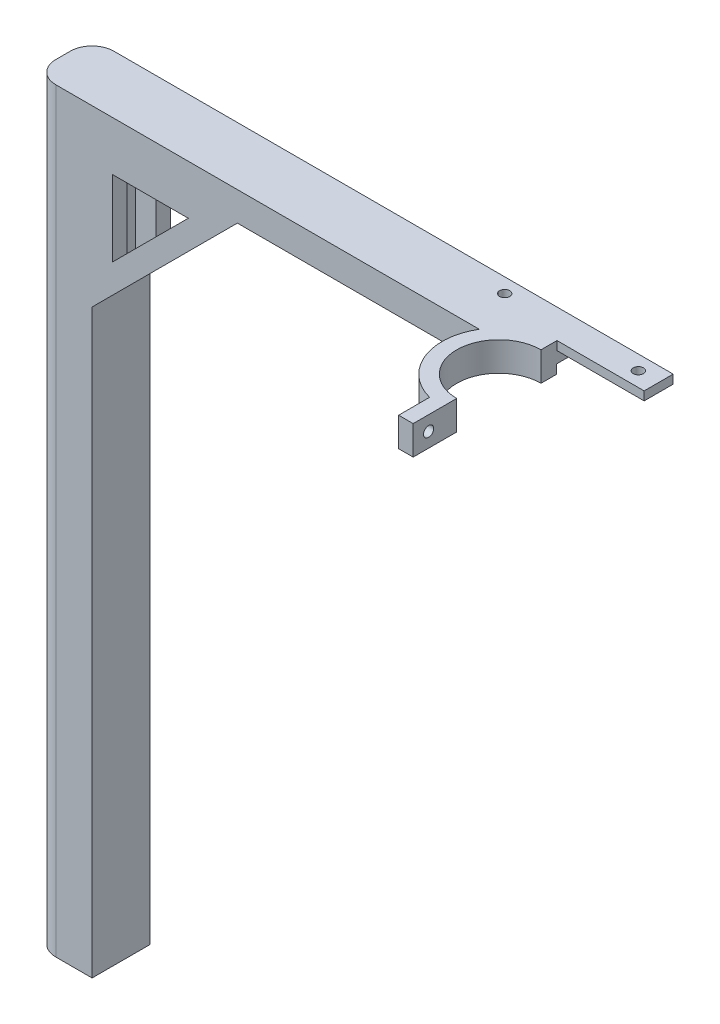
ISO-10303-21;
HEADER;
FILE_DESCRIPTION(('STEP AP214'),'2;1');
FILE_NAME('part.step','',(''),(''),'','','');
FILE_SCHEMA(('AUTOMOTIVE_DESIGN { 1 0 10303 214 1 1 1 1 }'));
ENDSEC;
DATA;
#1=APPLICATION_CONTEXT('core data for automotive mechanical design processes');
#2=APPLICATION_PROTOCOL_DEFINITION('international standard','automotive_design',2000,#1);
#3=PRODUCT_CONTEXT('',#1,'mechanical');
#4=PRODUCT('Part','Part','',(#3));
#5=PRODUCT_RELATED_PRODUCT_CATEGORY('part','',(#4));
#6=PRODUCT_DEFINITION_FORMATION('','',#4);
#7=PRODUCT_DEFINITION_CONTEXT('part definition',#1,'design');
#8=PRODUCT_DEFINITION('design','',#6,#7);
#9=PRODUCT_DEFINITION_SHAPE('','',#8);
#10=(LENGTH_UNIT() NAMED_UNIT(*) SI_UNIT(.MILLI.,.METRE.));
#11=(NAMED_UNIT(*) PLANE_ANGLE_UNIT() SI_UNIT($,.RADIAN.));
#12=(NAMED_UNIT(*) SI_UNIT($,.STERADIAN.) SOLID_ANGLE_UNIT());
#13=UNCERTAINTY_MEASURE_WITH_UNIT(LENGTH_MEASURE(1.E-05),#10,'distance_accuracy_value','');
#14=(GEOMETRIC_REPRESENTATION_CONTEXT(3) GLOBAL_UNCERTAINTY_ASSIGNED_CONTEXT((#13)) GLOBAL_UNIT_ASSIGNED_CONTEXT((#10,
#11,#12)) REPRESENTATION_CONTEXT('',''));
#15=CARTESIAN_POINT('',(0.,0.,0.));
#16=DIRECTION('',(0.,0.,1.));
#17=DIRECTION('',(1.,0.,0.));
#18=AXIS2_PLACEMENT_3D('',#15,#16,#17);
#19=CARTESIAN_POINT('',(170.,0.,0.));
#20=DIRECTION('',(1.,0.,0.));
#21=DIRECTION('',(0.,0.,-1.));
#22=AXIS2_PLACEMENT_3D('',#19,#20,#21);
#23=PLANE('',#22);
#24=DIRECTION('',(0.,-1.,0.));
#25=VECTOR('',#24,1.);
#26=CARTESIAN_POINT('',(170.,250.,-9.9));
#27=LINE('',#26,#25);
#28=CARTESIAN_POINT('',(170.,253.1,-9.9));
#29=VERTEX_POINT('',#28);
#30=CARTESIAN_POINT('',(170.,250.,-9.9));
#31=VERTEX_POINT('',#30);
#32=EDGE_CURVE('E284',#29,#31,#27,.T.);
#33=ORIENTED_EDGE('',*,*,#32,.F.);
#34=DIRECTION('',(0.,0.,1.));
#35=VECTOR('',#34,1.);
#36=CARTESIAN_POINT('',(170.,253.1,-20.));
#37=LINE('',#36,#35);
#38=CARTESIAN_POINT('',(170.,253.1,-20.));
#39=VERTEX_POINT('',#38);
#40=EDGE_CURVE('E519',#39,#29,#37,.T.);
#41=ORIENTED_EDGE('',*,*,#40,.F.);
#42=DIRECTION('',(0.,1.,0.));
#43=VECTOR('',#42,1.);
#44=CARTESIAN_POINT('',(170.,260.,-20.));
#45=LINE('',#44,#43);
#46=CARTESIAN_POINT('',(170.,257.,-20.));
#47=VERTEX_POINT('',#46);
#48=EDGE_CURVE('E290',#39,#47,#45,.T.);
#49=ORIENTED_EDGE('',*,*,#48,.T.);
#50=DIRECTION('',(0.,0.,-1.));
#51=VECTOR('',#50,1.);
#52=CARTESIAN_POINT('',(170.,257.,-20.));
#53=LINE('',#52,#51);
#54=CARTESIAN_POINT('',(170.,257.,-10.));
#55=VERTEX_POINT('',#54);
#56=EDGE_CURVE('E102',#55,#47,#53,.T.);
#57=ORIENTED_EDGE('',*,*,#56,.F.);
#58=DIRECTION('',(0.,-1.,0.));
#59=VECTOR('',#58,1.);
#60=CARTESIAN_POINT('',(170.,260.,-10.));
#61=LINE('',#60,#59);
#62=CARTESIAN_POINT('',(170.,260.,-10.));
#63=VERTEX_POINT('',#62);
#64=EDGE_CURVE('E307',#63,#55,#61,.T.);
#65=ORIENTED_EDGE('',*,*,#64,.F.);
#66=DIRECTION('',(0.,0.,1.));
#67=VECTOR('',#66,1.);
#68=CARTESIAN_POINT('',(170.,260.,0.));
#69=LINE('',#68,#67);
#70=CARTESIAN_POINT('',(170.,260.,-4.5));
#71=VERTEX_POINT('',#70);
#72=EDGE_CURVE('E468',#63,#71,#69,.T.);
#73=ORIENTED_EDGE('',*,*,#72,.T.);
#74=DIRECTION('',(0.,1.,0.));
#75=VECTOR('',#74,1.);
#76=CARTESIAN_POINT('',(170.,0.,-4.5));
#77=LINE('',#76,#75);
#78=CARTESIAN_POINT('',(170.,250.,-4.5));
#79=VERTEX_POINT('',#78);
#80=EDGE_CURVE('E500',#71,#79,#77,.F.);
#81=ORIENTED_EDGE('',*,*,#80,.T.);
#82=DIRECTION('',(0.,0.,-1.));
#83=VECTOR('',#82,1.);
#84=CARTESIAN_POINT('',(170.,250.,0.));
#85=LINE('',#84,#83);
#86=EDGE_CURVE('E464',#79,#31,#85,.T.);
#87=ORIENTED_EDGE('',*,*,#86,.T.);
#88=EDGE_LOOP('',(#33,#41,#49,#57,#65,#73,#81,#87));
#89=FACE_BOUND('',#88,.T.);
#90=ADVANCED_FACE('F77',(#89),#23,.T.);
#91=CARTESIAN_POINT('',(170.,250.,0.));
#92=DIRECTION('',(0.,1.,0.));
#93=DIRECTION('',(0.,0.,1.));
#94=AXIS2_PLACEMENT_3D('',#91,#92,#93);
#95=PLANE('',#94);
#96=DIRECTION('',(0.,0.,-1.));
#97=VECTOR('',#96,1.);
#98=CARTESIAN_POINT('',(139.8,250.,-20.));
#99=LINE('',#98,#97);
#100=CARTESIAN_POINT('',(139.8,250.,-9.9));
#101=VERTEX_POINT('',#100);
#102=CARTESIAN_POINT('',(139.8,250.,-20.));
#103=VERTEX_POINT('',#102);
#104=EDGE_CURVE('E94',#101,#103,#99,.T.);
#105=ORIENTED_EDGE('',*,*,#104,.F.);
#106=DIRECTION('',(1.,0.,0.));
#107=VECTOR('',#106,1.);
#108=CARTESIAN_POINT('',(139.8,250.,-9.9));
#109=LINE('',#108,#107);
#110=EDGE_CURVE('E292',#101,#31,#109,.T.);
#111=ORIENTED_EDGE('',*,*,#110,.T.);
#112=ORIENTED_EDGE('',*,*,#86,.F.);
#113=CARTESIAN_POINT('',(170.,250.,10.));
#114=DIRECTION('',(0.,1.,0.));
#115=DIRECTION('',(0.,0.,1.));
#116=AXIS2_PLACEMENT_3D('',#113,#114,#115);
#117=CIRCLE('',#116,14.5);
#118=CARTESIAN_POINT('',(170.,250.,24.5));
#119=VERTEX_POINT('',#118);
#120=EDGE_CURVE('E432',#79,#119,#117,.T.);
#121=ORIENTED_EDGE('',*,*,#120,.T.);
#122=DIRECTION('',(0.,0.,-1.));
#123=VECTOR('',#122,1.);
#124=CARTESIAN_POINT('',(170.,250.,0.));
#125=LINE('',#124,#123);
#126=CARTESIAN_POINT('',(170.,250.,39.5));
#127=VERTEX_POINT('',#126);
#128=EDGE_CURVE('E428',#127,#119,#125,.T.);
#129=ORIENTED_EDGE('',*,*,#128,.F.);
#130=DIRECTION('',(1.,0.,0.));
#131=VECTOR('',#130,1.);
#132=CARTESIAN_POINT('',(0.,250.,39.5));
#133=LINE('',#132,#131);
#134=CARTESIAN_POINT('',(165.,250.,39.5));
#135=VERTEX_POINT('',#134);
#136=EDGE_CURVE('E425',#135,#127,#133,.T.);
#137=ORIENTED_EDGE('',*,*,#136,.F.);
#138=DIRECTION('',(0.,0.,-1.));
#139=VECTOR('',#138,1.);
#140=CARTESIAN_POINT('',(165.,250.,0.));
#141=LINE('',#140,#139);
#142=CARTESIAN_POINT('',(165.,250.,28.8480768249708));
#143=VERTEX_POINT('',#142);
#144=EDGE_CURVE('E437',#135,#143,#141,.T.);
#145=ORIENTED_EDGE('',*,*,#144,.T.);
#146=CARTESIAN_POINT('',(170.,250.,10.));
#147=DIRECTION('',(0.,1.,0.));
#148=DIRECTION('',(0.,0.,1.));
#149=AXIS2_PLACEMENT_3D('',#146,#147,#148);
#150=CIRCLE('',#149,19.5);
#151=CARTESIAN_POINT('',(153.259330957217,250.,0.));
#152=VERTEX_POINT('',#151);
#153=EDGE_CURVE('E434',#152,#143,#150,.T.);
#154=ORIENTED_EDGE('',*,*,#153,.F.);
#155=DIRECTION('',(-1.,0.,0.));
#156=VECTOR('',#155,1.);
#157=CARTESIAN_POINT('',(170.,250.,0.));
#158=LINE('',#157,#156);
#159=CARTESIAN_POINT('',(70.,250.,0.));
#160=VERTEX_POINT('',#159);
#161=EDGE_CURVE('E474',#152,#160,#158,.T.);
#162=ORIENTED_EDGE('',*,*,#161,.T.);
#163=DIRECTION('',(0.,0.,1.));
#164=VECTOR('',#163,1.);
#165=CARTESIAN_POINT('',(70.,250.,-5.));
#166=LINE('',#165,#164);
#167=CARTESIAN_POINT('',(70.,250.,-5.));
#168=VERTEX_POINT('',#167);
#169=EDGE_CURVE('E415',#168,#160,#166,.T.);
#170=ORIENTED_EDGE('',*,*,#169,.F.);
#171=DIRECTION('',(1.,0.,0.));
#172=VECTOR('',#171,1.);
#173=CARTESIAN_POINT('',(20.,250.,-5.));
#174=LINE('',#173,#172);
#175=CARTESIAN_POINT('',(20.,250.,-5.));
#176=VERTEX_POINT('',#175);
#177=EDGE_CURVE('E401',#176,#168,#174,.T.);
#178=ORIENTED_EDGE('',*,*,#177,.F.);
#179=DIRECTION('',(0.,0.,-1.));
#180=VECTOR('',#179,1.);
#181=CARTESIAN_POINT('',(20.,250.,0.));
#182=LINE('',#181,#180);
#183=CARTESIAN_POINT('',(20.,250.,-15.));
#184=VERTEX_POINT('',#183);
#185=EDGE_CURVE('E463',#176,#184,#182,.T.);
#186=ORIENTED_EDGE('',*,*,#185,.T.);
#187=DIRECTION('',(1.,0.,0.));
#188=VECTOR('',#187,1.);
#189=CARTESIAN_POINT('',(20.,250.,-15.));
#190=LINE('',#189,#188);
#191=CARTESIAN_POINT('',(70.,250.,-15.));
#192=VERTEX_POINT('',#191);
#193=EDGE_CURVE('E360',#184,#192,#190,.T.);
#194=ORIENTED_EDGE('',*,*,#193,.T.);
#195=DIRECTION('',(0.,0.,-1.));
#196=VECTOR('',#195,1.);
#197=CARTESIAN_POINT('',(70.,250.,-15.));
#198=LINE('',#197,#196);
#199=CARTESIAN_POINT('',(70.,250.,-20.));
#200=VERTEX_POINT('',#199);
#201=EDGE_CURVE('E369',#192,#200,#198,.T.);
#202=ORIENTED_EDGE('',*,*,#201,.T.);
#203=DIRECTION('',(-1.,0.,0.));
#204=VECTOR('',#203,1.);
#205=CARTESIAN_POINT('',(170.,250.,-20.));
#206=LINE('',#205,#204);
#207=EDGE_CURVE('E470',#103,#200,#206,.T.);
#208=ORIENTED_EDGE('',*,*,#207,.F.);
#209=EDGE_LOOP('',(#105,#111,#112,#121,#129,#137,#145,#154,#162,#170,#178,#186,#194,#202,#208));
#210=FACE_BOUND('',#209,.T.);
#211=ADVANCED_FACE('F536',(#210),#95,.F.);
#212=CARTESIAN_POINT('',(20.,260.,0.));
#213=DIRECTION('',(-1.,0.,0.));
#214=DIRECTION('',(0.,0.,1.));
#215=AXIS2_PLACEMENT_3D('',#212,#213,#214);
#216=PLANE('',#215);
#217=DIRECTION('',(0.,-1.,0.));
#218=VECTOR('',#217,1.);
#219=CARTESIAN_POINT('',(20.,260.,-20.));
#220=LINE('',#219,#218);
#221=CARTESIAN_POINT('',(20.,200.,-20.));
#222=VERTEX_POINT('',#221);
#223=CARTESIAN_POINT('',(20.,0.,-20.));
#224=VERTEX_POINT('',#223);
#225=EDGE_CURVE('E486',#222,#224,#220,.T.);
#226=ORIENTED_EDGE('',*,*,#225,.F.);
#227=DIRECTION('',(0.,0.,-1.));
#228=VECTOR('',#227,1.);
#229=CARTESIAN_POINT('',(20.,200.,-15.));
#230=LINE('',#229,#228);
#231=CARTESIAN_POINT('',(20.,200.,-15.));
#232=VERTEX_POINT('',#231);
#233=EDGE_CURVE('E373',#232,#222,#230,.T.);
#234=ORIENTED_EDGE('',*,*,#233,.F.);
#235=DIRECTION('',(0.,1.,0.));
#236=VECTOR('',#235,1.);
#237=CARTESIAN_POINT('',(20.,200.,-15.));
#238=LINE('',#237,#236);
#239=EDGE_CURVE('E363',#232,#184,#238,.T.);
#240=ORIENTED_EDGE('',*,*,#239,.T.);
#241=ORIENTED_EDGE('',*,*,#185,.F.);
#242=DIRECTION('',(0.,1.,0.));
#243=VECTOR('',#242,1.);
#244=CARTESIAN_POINT('',(20.,200.,-5.));
#245=LINE('',#244,#243);
#246=CARTESIAN_POINT('',(20.,200.,-5.));
#247=VERTEX_POINT('',#246);
#248=EDGE_CURVE('E407',#247,#176,#245,.T.);
#249=ORIENTED_EDGE('',*,*,#248,.F.);
#250=DIRECTION('',(0.,0.,1.));
#251=VECTOR('',#250,1.);
#252=CARTESIAN_POINT('',(20.,200.,-5.));
#253=LINE('',#252,#251);
#254=CARTESIAN_POINT('',(20.,200.,0.));
#255=VERTEX_POINT('',#254);
#256=EDGE_CURVE('E410',#247,#255,#253,.T.);
#257=ORIENTED_EDGE('',*,*,#256,.T.);
#258=DIRECTION('',(0.,-1.,0.));
#259=VECTOR('',#258,1.);
#260=CARTESIAN_POINT('',(20.,260.,0.));
#261=LINE('',#260,#259);
#262=CARTESIAN_POINT('',(20.,0.,0.));
#263=VERTEX_POINT('',#262);
#264=EDGE_CURVE('E497',#255,#263,#261,.T.);
#265=ORIENTED_EDGE('',*,*,#264,.T.);
#266=DIRECTION('',(0.,0.,-1.));
#267=VECTOR('',#266,1.);
#268=CARTESIAN_POINT('',(20.,0.,0.));
#269=LINE('',#268,#267);
#270=EDGE_CURVE('E491',#263,#224,#269,.T.);
#271=ORIENTED_EDGE('',*,*,#270,.T.);
#272=EDGE_LOOP('',(#226,#234,#240,#241,#249,#257,#265,#271));
#273=FACE_BOUND('',#272,.T.);
#274=ADVANCED_FACE('F581',(#273),#216,.F.);
#275=CARTESIAN_POINT('',(0.,260.,0.));
#276=DIRECTION('',(0.,-1.,0.));
#277=DIRECTION('',(0.,0.,-1.));
#278=AXIS2_PLACEMENT_3D('',#275,#276,#277);
#279=PLANE('',#278);
#280=CARTESIAN_POINT('',(193.,260.,-15.));
#281=DIRECTION('',(0.,-1.,0.));
#282=DIRECTION('',(0.,0.,1.));
#283=AXIS2_PLACEMENT_3D('',#280,#281,#282);
#284=CIRCLE('',#283,1.75000000000001);
#285=CARTESIAN_POINT('',(193.,260.,-13.25));
#286=VERTEX_POINT('',#285);
#287=EDGE_CURVE('E529',#286,#286,#284,.T.);
#288=ORIENTED_EDGE('',*,*,#287,.T.);
#289=EDGE_LOOP('',(#288));
#290=FACE_BOUND('',#289,.T.);
#291=CARTESIAN_POINT('',(147.,260.,-15.));
#292=DIRECTION('',(0.,1.,0.));
#293=DIRECTION('',(0.,0.,1.));
#294=AXIS2_PLACEMENT_3D('',#291,#292,#293);
#295=CIRCLE('',#294,1.75000000000001);
#296=CARTESIAN_POINT('',(147.,260.,-13.25));
#297=VERTEX_POINT('',#296);
#298=EDGE_CURVE('E520',#297,#297,#295,.T.);
#299=ORIENTED_EDGE('',*,*,#298,.F.);
#300=EDGE_LOOP('',(#299));
#301=FACE_BOUND('',#300,.T.);
#302=DIRECTION('',(0.,0.,1.));
#303=VECTOR('',#302,1.);
#304=CARTESIAN_POINT('',(0.,260.,0.));
#305=LINE('',#304,#303);
#306=CARTESIAN_POINT('',(0.,260.,-12.5));
#307=VERTEX_POINT('',#306);
#308=CARTESIAN_POINT('',(0.,260.,-7.5));
#309=VERTEX_POINT('',#308);
#310=EDGE_CURVE('E477',#307,#309,#305,.T.);
#311=ORIENTED_EDGE('',*,*,#310,.T.);
#312=CARTESIAN_POINT('',(7.5,260.,-7.5));
#313=DIRECTION('',(0.,-1.,0.));
#314=DIRECTION('',(0.,0.,-1.));
#315=AXIS2_PLACEMENT_3D('',#312,#313,#314);
#316=CIRCLE('',#315,7.5);
#317=CARTESIAN_POINT('',(7.5,260.,0.));
#318=VERTEX_POINT('',#317);
#319=EDGE_CURVE('E86',#309,#318,#316,.F.);
#320=ORIENTED_EDGE('',*,*,#319,.T.);
#321=DIRECTION('',(1.,0.,0.));
#322=VECTOR('',#321,1.);
#323=CARTESIAN_POINT('',(0.,260.,0.));
#324=LINE('',#323,#322);
#325=CARTESIAN_POINT('',(153.259330957217,260.,0.));
#326=VERTEX_POINT('',#325);
#327=EDGE_CURVE('E480',#318,#326,#324,.T.);
#328=ORIENTED_EDGE('',*,*,#327,.T.);
#329=CARTESIAN_POINT('',(170.,260.,10.));
#330=DIRECTION('',(0.,1.,0.));
#331=DIRECTION('',(0.,0.,1.));
#332=AXIS2_PLACEMENT_3D('',#329,#330,#331);
#333=CIRCLE('',#332,19.5);
#334=CARTESIAN_POINT('',(165.,260.,28.8480768249708));
#335=VERTEX_POINT('',#334);
#336=EDGE_CURVE('E422',#335,#326,#333,.F.);
#337=ORIENTED_EDGE('',*,*,#336,.F.);
#338=DIRECTION('',(0.,0.,1.));
#339=VECTOR('',#338,1.);
#340=CARTESIAN_POINT('',(165.,260.,0.));
#341=LINE('',#340,#339);
#342=CARTESIAN_POINT('',(165.,260.,39.5));
#343=VERTEX_POINT('',#342);
#344=EDGE_CURVE('E440',#335,#343,#341,.T.);
#345=ORIENTED_EDGE('',*,*,#344,.T.);
#346=DIRECTION('',(-1.,0.,0.));
#347=VECTOR('',#346,1.);
#348=CARTESIAN_POINT('',(0.,260.,39.5));
#349=LINE('',#348,#347);
#350=CARTESIAN_POINT('',(170.,260.,39.5));
#351=VERTEX_POINT('',#350);
#352=EDGE_CURVE('E443',#351,#343,#349,.T.);
#353=ORIENTED_EDGE('',*,*,#352,.F.);
#354=DIRECTION('',(0.,0.,1.));
#355=VECTOR('',#354,1.);
#356=CARTESIAN_POINT('',(170.,260.,0.));
#357=LINE('',#356,#355);
#358=CARTESIAN_POINT('',(170.,260.,24.5));
#359=VERTEX_POINT('',#358);
#360=EDGE_CURVE('E446',#359,#351,#357,.T.);
#361=ORIENTED_EDGE('',*,*,#360,.F.);
#362=CARTESIAN_POINT('',(170.,260.,10.));
#363=DIRECTION('',(0.,1.,0.));
#364=DIRECTION('',(0.,0.,1.));
#365=AXIS2_PLACEMENT_3D('',#362,#363,#364);
#366=CIRCLE('',#365,14.5);
#367=EDGE_CURVE('E449',#359,#71,#366,.F.);
#368=ORIENTED_EDGE('',*,*,#367,.T.);
#369=ORIENTED_EDGE('',*,*,#72,.F.);
#370=DIRECTION('',(-1.,0.,0.));
#371=VECTOR('',#370,1.);
#372=CARTESIAN_POINT('',(200.,260.,-10.));
#373=LINE('',#372,#371);
#374=CARTESIAN_POINT('',(200.,260.,-10.));
#375=VERTEX_POINT('',#374);
#376=EDGE_CURVE('E314',#375,#63,#373,.T.);
#377=ORIENTED_EDGE('',*,*,#376,.F.);
#378=DIRECTION('',(0.,0.,1.));
#379=VECTOR('',#378,1.);
#380=CARTESIAN_POINT('',(200.,260.,-20.));
#381=LINE('',#380,#379);
#382=CARTESIAN_POINT('',(200.,260.,-20.));
#383=VERTEX_POINT('',#382);
#384=EDGE_CURVE('E300',#383,#375,#381,.T.);
#385=ORIENTED_EDGE('',*,*,#384,.F.);
#386=DIRECTION('',(-1.,0.,0.));
#387=VECTOR('',#386,1.);
#388=CARTESIAN_POINT('',(0.,260.,-20.));
#389=LINE('',#388,#387);
#390=CARTESIAN_POINT('',(7.5,260.,-20.));
#391=VERTEX_POINT('',#390);
#392=EDGE_CURVE('E483',#383,#391,#389,.T.);
#393=ORIENTED_EDGE('',*,*,#392,.T.);
#394=CARTESIAN_POINT('',(7.5,260.,-12.5));
#395=DIRECTION('',(0.,-1.,0.));
#396=DIRECTION('',(0.,0.,-1.));
#397=AXIS2_PLACEMENT_3D('',#394,#395,#396);
#398=CIRCLE('',#397,7.5);
#399=EDGE_CURVE('E515',#391,#307,#398,.F.);
#400=ORIENTED_EDGE('',*,*,#399,.T.);
#401=EDGE_LOOP('',(#311,#320,#328,#337,#345,#353,#361,#368,#369,#377,#385,#393,#400));
#402=FACE_BOUND('',#401,.T.);
#403=ADVANCED_FACE('F564',(#290,#301,#402),#279,.F.);
#404=CARTESIAN_POINT('',(0.,260.,0.));
#405=DIRECTION('',(1.,0.,0.));
#406=DIRECTION('',(0.,0.,-1.));
#407=AXIS2_PLACEMENT_3D('',#404,#405,#406);
#408=PLANE('',#407);
#409=DIRECTION('',(0.,0.,1.));
#410=VECTOR('',#409,1.);
#411=CARTESIAN_POINT('',(0.,0.,0.));
#412=LINE('',#411,#410);
#413=CARTESIAN_POINT('',(0.,0.,-12.5));
#414=VERTEX_POINT('',#413);
#415=CARTESIAN_POINT('',(0.,0.,-7.5));
#416=VERTEX_POINT('',#415);
#417=EDGE_CURVE('E476',#414,#416,#412,.T.);
#418=ORIENTED_EDGE('',*,*,#417,.T.);
#419=DIRECTION('',(0.,-1.,0.));
#420=VECTOR('',#419,1.);
#421=CARTESIAN_POINT('',(0.,260.,-7.5));
#422=LINE('',#421,#420);
#423=EDGE_CURVE('E513',#416,#309,#422,.F.);
#424=ORIENTED_EDGE('',*,*,#423,.T.);
#425=ORIENTED_EDGE('',*,*,#310,.F.);
#426=DIRECTION('',(0.,-1.,0.));
#427=VECTOR('',#426,1.);
#428=CARTESIAN_POINT('',(0.,260.,-12.5));
#429=LINE('',#428,#427);
#430=EDGE_CURVE('E510',#307,#414,#429,.T.);
#431=ORIENTED_EDGE('',*,*,#430,.T.);
#432=EDGE_LOOP('',(#418,#424,#425,#431));
#433=FACE_BOUND('',#432,.T.);
#434=ADVANCED_FACE('F600',(#433),#408,.F.);
#435=CARTESIAN_POINT('',(0.,260.,0.));
#436=DIRECTION('',(0.,0.,-1.));
#437=DIRECTION('',(-1.,0.,0.));
#438=AXIS2_PLACEMENT_3D('',#435,#436,#437);
#439=PLANE('',#438);
#440=ORIENTED_EDGE('',*,*,#327,.F.);
#441=DIRECTION('',(0.,-1.,0.));
#442=VECTOR('',#441,1.);
#443=CARTESIAN_POINT('',(7.5,260.,0.));
#444=LINE('',#443,#442);
#445=CARTESIAN_POINT('',(7.5,0.,0.));
#446=VERTEX_POINT('',#445);
#447=EDGE_CURVE('E503',#318,#446,#444,.T.);
#448=ORIENTED_EDGE('',*,*,#447,.T.);
#449=DIRECTION('',(1.,0.,0.));
#450=VECTOR('',#449,1.);
#451=CARTESIAN_POINT('',(0.,0.,0.));
#452=LINE('',#451,#450);
#453=EDGE_CURVE('E489',#446,#263,#452,.T.);
#454=ORIENTED_EDGE('',*,*,#453,.T.);
#455=ORIENTED_EDGE('',*,*,#264,.F.);
#456=DIRECTION('',(-0.707106781186548,-0.707106781186547,0.));
#457=VECTOR('',#456,1.);
#458=CARTESIAN_POINT('',(70.,250.,0.));
#459=LINE('',#458,#457);
#460=EDGE_CURVE('E396',#160,#255,#459,.T.);
#461=ORIENTED_EDGE('',*,*,#460,.F.);
#462=ORIENTED_EDGE('',*,*,#161,.F.);
#463=DIRECTION('',(0.,1.,0.));
#464=VECTOR('',#463,1.);
#465=CARTESIAN_POINT('',(153.259330957217,205.948893316966,0.));
#466=LINE('',#465,#464);
#467=EDGE_CURVE('E429',#152,#326,#466,.T.);
#468=ORIENTED_EDGE('',*,*,#467,.T.);
#469=EDGE_LOOP('',(#440,#448,#454,#455,#461,#462,#468));
#470=FACE_BOUND('',#469,.T.);
#471=DIRECTION('',(0.,1.,0.));
#472=VECTOR('',#471,1.);
#473=CARTESIAN_POINT('',(27.,0.,0.));
#474=LINE('',#473,#472);
#475=CARTESIAN_POINT('',(27.,216.899494936612,0.));
#476=VERTEX_POINT('',#475);
#477=CARTESIAN_POINT('',(27.,243.,0.));
#478=VERTEX_POINT('',#477);
#479=EDGE_CURVE('E388',#476,#478,#474,.T.);
#480=ORIENTED_EDGE('',*,*,#479,.T.);
#481=DIRECTION('',(1.,0.,0.));
#482=VECTOR('',#481,1.);
#483=CARTESIAN_POINT('',(0.,243.,0.));
#484=LINE('',#483,#482);
#485=CARTESIAN_POINT('',(53.1005050633883,243.,0.));
#486=VERTEX_POINT('',#485);
#487=EDGE_CURVE('E376',#478,#486,#484,.T.);
#488=ORIENTED_EDGE('',*,*,#487,.T.);
#489=DIRECTION('',(-0.707106781186548,-0.707106781186547,0.));
#490=VECTOR('',#489,1.);
#491=CARTESIAN_POINT('',(-94.9497474683059,94.9497474683059,0.));
#492=LINE('',#491,#490);
#493=EDGE_CURVE('E380',#486,#476,#492,.T.);
#494=ORIENTED_EDGE('',*,*,#493,.T.);
#495=EDGE_LOOP('',(#480,#488,#494));
#496=FACE_BOUND('',#495,.T.);
#497=ADVANCED_FACE('F567',(#470,#496),#439,.F.);
#498=CARTESIAN_POINT('',(0.,260.,-20.));
#499=DIRECTION('',(0.,0.,1.));
#500=DIRECTION('',(1.,0.,0.));
#501=AXIS2_PLACEMENT_3D('',#498,#499,#500);
#502=PLANE('',#501);
#503=ORIENTED_EDGE('',*,*,#48,.F.);
#504=DIRECTION('',(1.,0.,0.));
#505=VECTOR('',#504,1.);
#506=CARTESIAN_POINT('',(139.8,253.1,-20.));
#507=LINE('',#506,#505);
#508=CARTESIAN_POINT('',(139.8,253.1,-20.));
#509=VERTEX_POINT('',#508);
#510=EDGE_CURVE('E274',#509,#39,#507,.T.);
#511=ORIENTED_EDGE('',*,*,#510,.F.);
#512=DIRECTION('',(0.,1.,0.));
#513=VECTOR('',#512,1.);
#514=CARTESIAN_POINT('',(139.8,250.,-20.));
#515=LINE('',#514,#513);
#516=EDGE_CURVE('E279',#103,#509,#515,.T.);
#517=ORIENTED_EDGE('',*,*,#516,.F.);
#518=ORIENTED_EDGE('',*,*,#207,.T.);
#519=DIRECTION('',(-0.707106781186548,-0.707106781186547,0.));
#520=VECTOR('',#519,1.);
#521=CARTESIAN_POINT('',(70.,250.,-20.));
#522=LINE('',#521,#520);
#523=EDGE_CURVE('E355',#200,#222,#522,.T.);
#524=ORIENTED_EDGE('',*,*,#523,.T.);
#525=ORIENTED_EDGE('',*,*,#225,.T.);
#526=DIRECTION('',(-1.,0.,0.));
#527=VECTOR('',#526,1.);
#528=CARTESIAN_POINT('',(0.,0.,-20.));
#529=LINE('',#528,#527);
#530=CARTESIAN_POINT('',(7.5,0.,-20.));
#531=VERTEX_POINT('',#530);
#532=EDGE_CURVE('E481',#224,#531,#529,.T.);
#533=ORIENTED_EDGE('',*,*,#532,.T.);
#534=DIRECTION('',(0.,-1.,0.));
#535=VECTOR('',#534,1.);
#536=CARTESIAN_POINT('',(7.5,260.,-20.));
#537=LINE('',#536,#535);
#538=EDGE_CURVE('E12',#531,#391,#537,.F.);
#539=ORIENTED_EDGE('',*,*,#538,.T.);
#540=ORIENTED_EDGE('',*,*,#392,.F.);
#541=DIRECTION('',(0.,1.,0.));
#542=VECTOR('',#541,1.);
#543=CARTESIAN_POINT('',(200.,260.,-20.));
#544=LINE('',#543,#542);
#545=CARTESIAN_POINT('',(200.,257.,-20.));
#546=VERTEX_POINT('',#545);
#547=EDGE_CURVE('E297',#546,#383,#544,.T.);
#548=ORIENTED_EDGE('',*,*,#547,.F.);
#549=DIRECTION('',(-1.,0.,0.));
#550=VECTOR('',#549,1.);
#551=CARTESIAN_POINT('',(200.,257.,-20.));
#552=LINE('',#551,#550);
#553=EDGE_CURVE('E306',#546,#47,#552,.T.);
#554=ORIENTED_EDGE('',*,*,#553,.T.);
#555=EDGE_LOOP('',(#503,#511,#517,#518,#524,#525,#533,#539,#540,#548,#554));
#556=FACE_BOUND('',#555,.T.);
#557=DIRECTION('',(1.,0.,0.));
#558=VECTOR('',#557,1.);
#559=CARTESIAN_POINT('',(0.,243.,-20.));
#560=LINE('',#559,#558);
#561=CARTESIAN_POINT('',(27.,243.,-20.));
#562=VERTEX_POINT('',#561);
#563=CARTESIAN_POINT('',(53.1005050633883,243.,-20.));
#564=VERTEX_POINT('',#563);
#565=EDGE_CURVE('E333',#562,#564,#560,.T.);
#566=ORIENTED_EDGE('',*,*,#565,.F.);
#567=DIRECTION('',(0.,1.,0.));
#568=VECTOR('',#567,1.);
#569=CARTESIAN_POINT('',(27.,0.,-20.));
#570=LINE('',#569,#568);
#571=CARTESIAN_POINT('',(27.,216.899494936612,-20.));
#572=VERTEX_POINT('',#571);
#573=EDGE_CURVE('E340',#572,#562,#570,.T.);
#574=ORIENTED_EDGE('',*,*,#573,.F.);
#575=DIRECTION('',(-0.707106781186548,-0.707106781186547,0.));
#576=VECTOR('',#575,1.);
#577=CARTESIAN_POINT('',(-94.9497474683059,94.9497474683059,-20.));
#578=LINE('',#577,#576);
#579=EDGE_CURVE('E348',#564,#572,#578,.T.);
#580=ORIENTED_EDGE('',*,*,#579,.F.);
#581=EDGE_LOOP('',(#566,#574,#580));
#582=FACE_BOUND('',#581,.T.);
#583=ADVANCED_FACE('F287',(#556,#582),#502,.F.);
#584=CARTESIAN_POINT('',(0.,0.,0.));
#585=DIRECTION('',(0.,-1.,0.));
#586=DIRECTION('',(0.,0.,-1.));
#587=AXIS2_PLACEMENT_3D('',#584,#585,#586);
#588=PLANE('',#587);
#589=CARTESIAN_POINT('',(15.,0.,-15.));
#590=DIRECTION('',(0.,-1.,0.));
#591=DIRECTION('',(0.,0.,-1.));
#592=AXIS2_PLACEMENT_3D('',#589,#590,#591);
#593=CIRCLE('',#592,2.5);
#594=CARTESIAN_POINT('',(15.,0.,-17.5));
#595=VERTEX_POINT('',#594);
#596=EDGE_CURVE('E325',#595,#595,#593,.T.);
#597=ORIENTED_EDGE('',*,*,#596,.F.);
#598=EDGE_LOOP('',(#597));
#599=FACE_BOUND('',#598,.T.);
#600=CARTESIAN_POINT('',(5.,0.,-10.));
#601=DIRECTION('',(0.,-1.,0.));
#602=DIRECTION('',(0.,0.,-1.));
#603=AXIS2_PLACEMENT_3D('',#600,#601,#602);
#604=CIRCLE('',#603,2.5);
#605=CARTESIAN_POINT('',(5.,0.,-12.5));
#606=VERTEX_POINT('',#605);
#607=EDGE_CURVE('E318',#606,#606,#604,.T.);
#608=ORIENTED_EDGE('',*,*,#607,.F.);
#609=EDGE_LOOP('',(#608));
#610=FACE_BOUND('',#609,.T.);
#611=CARTESIAN_POINT('',(15.,0.,-5.));
#612=DIRECTION('',(0.,-1.,0.));
#613=DIRECTION('',(0.,0.,-1.));
#614=AXIS2_PLACEMENT_3D('',#611,#612,#613);
#615=CIRCLE('',#614,2.5);
#616=CARTESIAN_POINT('',(15.,0.,-7.5));
#617=VERTEX_POINT('',#616);
#618=EDGE_CURVE('E321',#617,#617,#615,.T.);
#619=ORIENTED_EDGE('',*,*,#618,.F.);
#620=EDGE_LOOP('',(#619));
#621=FACE_BOUND('',#620,.T.);
#622=ORIENTED_EDGE('',*,*,#453,.F.);
#623=CARTESIAN_POINT('',(7.5,0.,-7.5));
#624=DIRECTION('',(0.,-1.,0.));
#625=DIRECTION('',(0.,0.,-1.));
#626=AXIS2_PLACEMENT_3D('',#623,#624,#625);
#627=CIRCLE('',#626,7.5);
#628=EDGE_CURVE('E508',#446,#416,#627,.T.);
#629=ORIENTED_EDGE('',*,*,#628,.T.);
#630=ORIENTED_EDGE('',*,*,#417,.F.);
#631=CARTESIAN_POINT('',(7.5,0.,-12.5));
#632=DIRECTION('',(0.,-1.,0.));
#633=DIRECTION('',(0.,0.,-1.));
#634=AXIS2_PLACEMENT_3D('',#631,#632,#633);
#635=CIRCLE('',#634,7.5);
#636=EDGE_CURVE('E506',#414,#531,#635,.T.);
#637=ORIENTED_EDGE('',*,*,#636,.T.);
#638=ORIENTED_EDGE('',*,*,#532,.F.);
#639=ORIENTED_EDGE('',*,*,#270,.F.);
#640=EDGE_LOOP('',(#622,#629,#630,#637,#638,#639));
#641=FACE_BOUND('',#640,.T.);
#642=ADVANCED_FACE('F606',(#599,#610,#621,#641),#588,.T.);
#643=CARTESIAN_POINT('',(170.,205.948893316966,10.));
#644=DIRECTION('',(0.,1.,0.));
#645=DIRECTION('',(0.,0.,1.));
#646=AXIS2_PLACEMENT_3D('',#643,#644,#645);
#647=CYLINDRICAL_SURFACE('',#646,19.5);
#648=ORIENTED_EDGE('',*,*,#467,.F.);
#649=ORIENTED_EDGE('',*,*,#153,.T.);
#650=DIRECTION('',(0.,1.,0.));
#651=VECTOR('',#650,1.);
#652=CARTESIAN_POINT('',(165.,205.948893316966,28.8480768249708));
#653=LINE('',#652,#651);
#654=EDGE_CURVE('E452',#143,#335,#653,.T.);
#655=ORIENTED_EDGE('',*,*,#654,.T.);
#656=ORIENTED_EDGE('',*,*,#336,.T.);
#657=EDGE_LOOP('',(#648,#649,#655,#656));
#658=FACE_BOUND('',#657,.T.);
#659=ADVANCED_FACE('F558',(#658),#647,.T.);
#660=CARTESIAN_POINT('',(170.,205.948893316966,10.));
#661=DIRECTION('',(0.,1.,0.));
#662=DIRECTION('',(0.,0.,1.));
#663=AXIS2_PLACEMENT_3D('',#660,#661,#662);
#664=CYLINDRICAL_SURFACE('',#663,14.5);
#665=ORIENTED_EDGE('',*,*,#120,.F.);
#666=ORIENTED_EDGE('',*,*,#80,.F.);
#667=ORIENTED_EDGE('',*,*,#367,.F.);
#668=DIRECTION('',(0.,1.,0.));
#669=VECTOR('',#668,1.);
#670=CARTESIAN_POINT('',(170.,205.948893316966,24.5));
#671=LINE('',#670,#669);
#672=EDGE_CURVE('E455',#119,#359,#671,.T.);
#673=ORIENTED_EDGE('',*,*,#672,.F.);
#674=EDGE_LOOP('',(#665,#666,#667,#673));
#675=FACE_BOUND('',#674,.T.);
#676=ADVANCED_FACE('F543',(#675),#664,.F.);
#677=CARTESIAN_POINT('',(170.,205.948893316966,0.));
#678=DIRECTION('',(-1.,0.,0.));
#679=DIRECTION('',(0.,0.,1.));
#680=AXIS2_PLACEMENT_3D('',#677,#678,#679);
#681=PLANE('',#680);
#682=CARTESIAN_POINT('',(170.,255.,34.1740384124854));
#683=DIRECTION('',(-1.,0.,0.));
#684=DIRECTION('',(0.,0.,1.));
#685=AXIS2_PLACEMENT_3D('',#682,#683,#684);
#686=CIRCLE('',#685,1.75);
#687=CARTESIAN_POINT('',(170.,255.,35.9240384124854));
#688=VERTEX_POINT('',#687);
#689=EDGE_CURVE('E419',#688,#688,#686,.T.);
#690=ORIENTED_EDGE('',*,*,#689,.T.);
#691=EDGE_LOOP('',(#690));
#692=FACE_BOUND('',#691,.T.);
#693=DIRECTION('',(0.,1.,0.));
#694=VECTOR('',#693,1.);
#695=CARTESIAN_POINT('',(170.,205.948893316966,39.5));
#696=LINE('',#695,#694);
#697=EDGE_CURVE('E457',#127,#351,#696,.T.);
#698=ORIENTED_EDGE('',*,*,#697,.F.);
#699=ORIENTED_EDGE('',*,*,#128,.T.);
#700=ORIENTED_EDGE('',*,*,#672,.T.);
#701=ORIENTED_EDGE('',*,*,#360,.T.);
#702=EDGE_LOOP('',(#698,#699,#700,#701));
#703=FACE_BOUND('',#702,.T.);
#704=ADVANCED_FACE('F547',(#692,#703),#681,.F.);
#705=CARTESIAN_POINT('',(0.,205.948893316966,39.5));
#706=DIRECTION('',(0.,0.,-1.));
#707=DIRECTION('',(-1.,0.,0.));
#708=AXIS2_PLACEMENT_3D('',#705,#706,#707);
#709=PLANE('',#708);
#710=DIRECTION('',(0.,1.,0.));
#711=VECTOR('',#710,1.);
#712=CARTESIAN_POINT('',(165.,205.948893316966,39.5));
#713=LINE('',#712,#711);
#714=EDGE_CURVE('E459',#135,#343,#713,.T.);
#715=ORIENTED_EDGE('',*,*,#714,.F.);
#716=ORIENTED_EDGE('',*,*,#136,.T.);
#717=ORIENTED_EDGE('',*,*,#697,.T.);
#718=ORIENTED_EDGE('',*,*,#352,.T.);
#719=EDGE_LOOP('',(#715,#716,#717,#718));
#720=FACE_BOUND('',#719,.T.);
#721=ADVANCED_FACE('F552',(#720),#709,.F.);
#722=CARTESIAN_POINT('',(165.,205.948893316966,0.));
#723=DIRECTION('',(-1.,0.,0.));
#724=DIRECTION('',(0.,0.,1.));
#725=AXIS2_PLACEMENT_3D('',#722,#723,#724);
#726=PLANE('',#725);
#727=CARTESIAN_POINT('',(165.,255.,34.1740384124854));
#728=DIRECTION('',(-1.,0.,0.));
#729=DIRECTION('',(0.,0.,1.));
#730=AXIS2_PLACEMENT_3D('',#727,#728,#729);
#731=CIRCLE('',#730,1.75);
#732=CARTESIAN_POINT('',(165.,255.,35.9240384124854));
#733=VERTEX_POINT('',#732);
#734=EDGE_CURVE('E418',#733,#733,#731,.T.);
#735=ORIENTED_EDGE('',*,*,#734,.F.);
#736=EDGE_LOOP('',(#735));
#737=FACE_BOUND('',#736,.T.);
#738=ORIENTED_EDGE('',*,*,#144,.F.);
#739=ORIENTED_EDGE('',*,*,#714,.T.);
#740=ORIENTED_EDGE('',*,*,#344,.F.);
#741=ORIENTED_EDGE('',*,*,#654,.F.);
#742=EDGE_LOOP('',(#738,#739,#740,#741));
#743=FACE_BOUND('',#742,.T.);
#744=ADVANCED_FACE('F562',(#737,#743),#726,.T.);
#745=CARTESIAN_POINT('',(170.,255.,34.1740384124854));
#746=DIRECTION('',(-1.,0.,0.));
#747=DIRECTION('',(0.,0.,1.));
#748=AXIS2_PLACEMENT_3D('',#745,#746,#747);
#749=CYLINDRICAL_SURFACE('',#748,1.75);
#750=ORIENTED_EDGE('',*,*,#689,.F.);
#751=EDGE_LOOP('',(#750));
#752=FACE_BOUND('',#751,.T.);
#753=ORIENTED_EDGE('',*,*,#734,.T.);
#754=EDGE_LOOP('',(#753));
#755=FACE_BOUND('',#754,.T.);
#756=ADVANCED_FACE('F720',(#752,#755),#749,.F.);
#757=CARTESIAN_POINT('',(0.,0.,-5.));
#758=DIRECTION('',(0.,0.,1.));
#759=DIRECTION('',(1.,0.,0.));
#760=AXIS2_PLACEMENT_3D('',#757,#758,#759);
#761=PLANE('',#760);
#762=ORIENTED_EDGE('',*,*,#177,.T.);
#763=DIRECTION('',(-0.707106781186548,-0.707106781186547,0.));
#764=VECTOR('',#763,1.);
#765=CARTESIAN_POINT('',(70.,250.,-5.));
#766=LINE('',#765,#764);
#767=EDGE_CURVE('E404',#168,#247,#766,.T.);
#768=ORIENTED_EDGE('',*,*,#767,.T.);
#769=ORIENTED_EDGE('',*,*,#248,.T.);
#770=EDGE_LOOP('',(#762,#768,#769));
#771=FACE_BOUND('',#770,.T.);
#772=DIRECTION('',(1.,0.,0.));
#773=VECTOR('',#772,1.);
#774=CARTESIAN_POINT('',(0.,243.,-5.));
#775=LINE('',#774,#773);
#776=CARTESIAN_POINT('',(27.,243.,-5.));
#777=VERTEX_POINT('',#776);
#778=CARTESIAN_POINT('',(53.1005050633883,243.,-5.));
#779=VERTEX_POINT('',#778);
#780=EDGE_CURVE('E377',#777,#779,#775,.T.);
#781=ORIENTED_EDGE('',*,*,#780,.F.);
#782=DIRECTION('',(0.,1.,0.));
#783=VECTOR('',#782,1.);
#784=CARTESIAN_POINT('',(27.,0.,-5.));
#785=LINE('',#784,#783);
#786=CARTESIAN_POINT('',(27.,216.899494936612,-5.));
#787=VERTEX_POINT('',#786);
#788=EDGE_CURVE('E379',#787,#777,#785,.T.);
#789=ORIENTED_EDGE('',*,*,#788,.F.);
#790=DIRECTION('',(-0.707106781186548,-0.707106781186547,0.));
#791=VECTOR('',#790,1.);
#792=CARTESIAN_POINT('',(-94.9497474683059,94.9497474683059,-5.));
#793=LINE('',#792,#791);
#794=EDGE_CURVE('E382',#779,#787,#793,.T.);
#795=ORIENTED_EDGE('',*,*,#794,.F.);
#796=EDGE_LOOP('',(#781,#789,#795));
#797=FACE_BOUND('',#796,.T.);
#798=ADVANCED_FACE('F577',(#771,#797),#761,.F.);
#799=CARTESIAN_POINT('',(70.,250.,-5.));
#800=DIRECTION('',(-0.707106781186547,0.707106781186548,0.));
#801=DIRECTION('',(-0.707106781186548,-0.707106781186547,0.));
#802=AXIS2_PLACEMENT_3D('',#799,#800,#801);
#803=PLANE('',#802);
#804=ORIENTED_EDGE('',*,*,#460,.T.);
#805=ORIENTED_EDGE('',*,*,#256,.F.);
#806=ORIENTED_EDGE('',*,*,#767,.F.);
#807=ORIENTED_EDGE('',*,*,#169,.T.);
#808=EDGE_LOOP('',(#804,#805,#806,#807));
#809=FACE_BOUND('',#808,.T.);
#810=ADVANCED_FACE('F575',(#809),#803,.F.);
#811=CARTESIAN_POINT('',(0.,243.,-5.));
#812=DIRECTION('',(0.,-1.,0.));
#813=DIRECTION('',(0.,0.,-1.));
#814=AXIS2_PLACEMENT_3D('',#811,#812,#813);
#815=PLANE('',#814);
#816=ORIENTED_EDGE('',*,*,#487,.F.);
#817=DIRECTION('',(0.,0.,1.));
#818=VECTOR('',#817,1.);
#819=CARTESIAN_POINT('',(27.,243.,-5.));
#820=LINE('',#819,#818);
#821=EDGE_CURVE('E385',#777,#478,#820,.T.);
#822=ORIENTED_EDGE('',*,*,#821,.F.);
#823=ORIENTED_EDGE('',*,*,#780,.T.);
#824=DIRECTION('',(0.,0.,1.));
#825=VECTOR('',#824,1.);
#826=CARTESIAN_POINT('',(53.1005050633883,243.,-5.));
#827=LINE('',#826,#825);
#828=EDGE_CURVE('E393',#779,#486,#827,.T.);
#829=ORIENTED_EDGE('',*,*,#828,.T.);
#830=EDGE_LOOP('',(#816,#822,#823,#829));
#831=FACE_BOUND('',#830,.T.);
#832=ADVANCED_FACE('F710',(#831),#815,.T.);
#833=CARTESIAN_POINT('',(-94.9497474683059,94.9497474683059,-5.));
#834=DIRECTION('',(-0.707106781186547,0.707106781186548,0.));
#835=DIRECTION('',(-0.707106781186548,-0.707106781186547,0.));
#836=AXIS2_PLACEMENT_3D('',#833,#834,#835);
#837=PLANE('',#836);
#838=ORIENTED_EDGE('',*,*,#493,.F.);
#839=ORIENTED_EDGE('',*,*,#828,.F.);
#840=ORIENTED_EDGE('',*,*,#794,.T.);
#841=DIRECTION('',(0.,0.,1.));
#842=VECTOR('',#841,1.);
#843=CARTESIAN_POINT('',(27.,216.899494936612,-5.));
#844=LINE('',#843,#842);
#845=EDGE_CURVE('E397',#787,#476,#844,.T.);
#846=ORIENTED_EDGE('',*,*,#845,.T.);
#847=EDGE_LOOP('',(#838,#839,#840,#846));
#848=FACE_BOUND('',#847,.T.);
#849=ADVANCED_FACE('F707',(#848),#837,.T.);
#850=CARTESIAN_POINT('',(27.,0.,-5.));
#851=DIRECTION('',(1.,0.,0.));
#852=DIRECTION('',(0.,0.,-1.));
#853=AXIS2_PLACEMENT_3D('',#850,#851,#852);
#854=PLANE('',#853);
#855=ORIENTED_EDGE('',*,*,#479,.F.);
#856=ORIENTED_EDGE('',*,*,#845,.F.);
#857=ORIENTED_EDGE('',*,*,#788,.T.);
#858=ORIENTED_EDGE('',*,*,#821,.T.);
#859=EDGE_LOOP('',(#855,#856,#857,#858));
#860=FACE_BOUND('',#859,.T.);
#861=ADVANCED_FACE('F706',(#860),#854,.T.);
#862=CARTESIAN_POINT('',(70.,250.,-15.));
#863=DIRECTION('',(0.707106781186547,-0.707106781186548,0.));
#864=DIRECTION('',(0.707106781186548,0.707106781186547,0.));
#865=AXIS2_PLACEMENT_3D('',#862,#863,#864);
#866=PLANE('',#865);
#867=ORIENTED_EDGE('',*,*,#523,.F.);
#868=ORIENTED_EDGE('',*,*,#201,.F.);
#869=DIRECTION('',(-0.707106781186548,-0.707106781186547,0.));
#870=VECTOR('',#869,1.);
#871=CARTESIAN_POINT('',(70.,250.,-15.));
#872=LINE('',#871,#870);
#873=EDGE_CURVE('E366',#192,#232,#872,.T.);
#874=ORIENTED_EDGE('',*,*,#873,.T.);
#875=ORIENTED_EDGE('',*,*,#233,.T.);
#876=EDGE_LOOP('',(#867,#868,#874,#875));
#877=FACE_BOUND('',#876,.T.);
#878=ADVANCED_FACE('F588',(#877),#866,.T.);
#879=CARTESIAN_POINT('',(0.,0.,-15.));
#880=DIRECTION('',(0.,0.,-1.));
#881=DIRECTION('',(1.,0.,0.));
#882=AXIS2_PLACEMENT_3D('',#879,#880,#881);
#883=PLANE('',#882);
#884=DIRECTION('',(0.,1.,0.));
#885=VECTOR('',#884,1.);
#886=CARTESIAN_POINT('',(27.,0.,-15.));
#887=LINE('',#886,#885);
#888=CARTESIAN_POINT('',(27.,216.899494936612,-15.));
#889=VERTEX_POINT('',#888);
#890=CARTESIAN_POINT('',(27.,243.,-15.));
#891=VERTEX_POINT('',#890);
#892=EDGE_CURVE('E343',#889,#891,#887,.T.);
#893=ORIENTED_EDGE('',*,*,#892,.T.);
#894=DIRECTION('',(1.,0.,0.));
#895=VECTOR('',#894,1.);
#896=CARTESIAN_POINT('',(0.,243.,-15.));
#897=LINE('',#896,#895);
#898=CARTESIAN_POINT('',(53.1005050633883,243.,-15.));
#899=VERTEX_POINT('',#898);
#900=EDGE_CURVE('E336',#891,#899,#897,.T.);
#901=ORIENTED_EDGE('',*,*,#900,.T.);
#902=DIRECTION('',(-0.707106781186548,-0.707106781186547,0.));
#903=VECTOR('',#902,1.);
#904=CARTESIAN_POINT('',(-94.9497474683059,94.9497474683059,-15.));
#905=LINE('',#904,#903);
#906=EDGE_CURVE('E339',#899,#889,#905,.T.);
#907=ORIENTED_EDGE('',*,*,#906,.T.);
#908=EDGE_LOOP('',(#893,#901,#907));
#909=FACE_BOUND('',#908,.T.);
#910=ORIENTED_EDGE('',*,*,#193,.F.);
#911=ORIENTED_EDGE('',*,*,#239,.F.);
#912=ORIENTED_EDGE('',*,*,#873,.F.);
#913=EDGE_LOOP('',(#910,#911,#912));
#914=FACE_BOUND('',#913,.T.);
#915=ADVANCED_FACE('F585',(#909,#914),#883,.F.);
#916=CARTESIAN_POINT('',(0.,243.,-15.));
#917=DIRECTION('',(0.,1.,0.));
#918=DIRECTION('',(0.,0.,1.));
#919=AXIS2_PLACEMENT_3D('',#916,#917,#918);
#920=PLANE('',#919);
#921=ORIENTED_EDGE('',*,*,#565,.T.);
#922=DIRECTION('',(0.,0.,-1.));
#923=VECTOR('',#922,1.);
#924=CARTESIAN_POINT('',(53.1005050633883,243.,-15.));
#925=LINE('',#924,#923);
#926=EDGE_CURVE('E346',#899,#564,#925,.T.);
#927=ORIENTED_EDGE('',*,*,#926,.F.);
#928=ORIENTED_EDGE('',*,*,#900,.F.);
#929=DIRECTION('',(0.,0.,-1.));
#930=VECTOR('',#929,1.);
#931=CARTESIAN_POINT('',(27.,243.,-15.));
#932=LINE('',#931,#930);
#933=EDGE_CURVE('E353',#891,#562,#932,.T.);
#934=ORIENTED_EDGE('',*,*,#933,.T.);
#935=EDGE_LOOP('',(#921,#927,#928,#934));
#936=FACE_BOUND('',#935,.T.);
#937=ADVANCED_FACE('F693',(#936),#920,.F.);
#938=CARTESIAN_POINT('',(27.,0.,-15.));
#939=DIRECTION('',(-1.,0.,0.));
#940=DIRECTION('',(0.,0.,1.));
#941=AXIS2_PLACEMENT_3D('',#938,#939,#940);
#942=PLANE('',#941);
#943=ORIENTED_EDGE('',*,*,#573,.T.);
#944=ORIENTED_EDGE('',*,*,#933,.F.);
#945=ORIENTED_EDGE('',*,*,#892,.F.);
#946=DIRECTION('',(0.,0.,-1.));
#947=VECTOR('',#946,1.);
#948=CARTESIAN_POINT('',(27.,216.899494936612,-15.));
#949=LINE('',#948,#947);
#950=EDGE_CURVE('E356',#889,#572,#949,.T.);
#951=ORIENTED_EDGE('',*,*,#950,.T.);
#952=EDGE_LOOP('',(#943,#944,#945,#951));
#953=FACE_BOUND('',#952,.T.);
#954=ADVANCED_FACE('F689',(#953),#942,.F.);
#955=CARTESIAN_POINT('',(-94.9497474683059,94.9497474683059,-15.));
#956=DIRECTION('',(0.707106781186547,-0.707106781186548,0.));
#957=DIRECTION('',(0.707106781186548,0.707106781186547,0.));
#958=AXIS2_PLACEMENT_3D('',#955,#956,#957);
#959=PLANE('',#958);
#960=ORIENTED_EDGE('',*,*,#579,.T.);
#961=ORIENTED_EDGE('',*,*,#950,.F.);
#962=ORIENTED_EDGE('',*,*,#906,.F.);
#963=ORIENTED_EDGE('',*,*,#926,.T.);
#964=EDGE_LOOP('',(#960,#961,#962,#963));
#965=FACE_BOUND('',#964,.T.);
#966=ADVANCED_FACE('F692',(#965),#959,.F.);
#967=CARTESIAN_POINT('',(7.5,260.,-7.5));
#968=DIRECTION('',(0.,-1.,0.));
#969=DIRECTION('',(0.,0.,-1.));
#970=AXIS2_PLACEMENT_3D('',#967,#968,#969);
#971=CYLINDRICAL_SURFACE('',#970,7.5);
#972=ORIENTED_EDGE('',*,*,#319,.F.);
#973=ORIENTED_EDGE('',*,*,#423,.F.);
#974=ORIENTED_EDGE('',*,*,#628,.F.);
#975=ORIENTED_EDGE('',*,*,#447,.F.);
#976=EDGE_LOOP('',(#972,#973,#974,#975));
#977=FACE_BOUND('',#976,.T.);
#978=ADVANCED_FACE('F604',(#977),#971,.T.);
#979=CARTESIAN_POINT('',(7.5,260.,-12.5));
#980=DIRECTION('',(0.,-1.,0.));
#981=DIRECTION('',(0.,0.,-1.));
#982=AXIS2_PLACEMENT_3D('',#979,#980,#981);
#983=CYLINDRICAL_SURFACE('',#982,7.5);
#984=ORIENTED_EDGE('',*,*,#399,.F.);
#985=ORIENTED_EDGE('',*,*,#538,.F.);
#986=ORIENTED_EDGE('',*,*,#636,.F.);
#987=ORIENTED_EDGE('',*,*,#430,.F.);
#988=EDGE_LOOP('',(#984,#985,#986,#987));
#989=FACE_BOUND('',#988,.T.);
#990=ADVANCED_FACE('F79',(#989),#983,.T.);
#991=CARTESIAN_POINT('',(15.,8.,-5.));
#992=DIRECTION('',(0.,-1.,0.));
#993=DIRECTION('',(0.,0.,-1.));
#994=AXIS2_PLACEMENT_3D('',#991,#992,#993);
#995=CYLINDRICAL_SURFACE('',#994,2.5);
#996=CARTESIAN_POINT('',(15.,8.,-5.));
#997=DIRECTION('',(0.,-1.,0.));
#998=DIRECTION('',(0.,0.,-1.));
#999=AXIS2_PLACEMENT_3D('',#996,#997,#998);
#1000=CIRCLE('',#999,2.5);
#1001=CARTESIAN_POINT('',(15.,8.,-7.5));
#1002=VERTEX_POINT('',#1001);
#1003=EDGE_CURVE('E330',#1002,#1002,#1000,.T.);
#1004=ORIENTED_EDGE('',*,*,#1003,.F.);
#1005=EDGE_LOOP('',(#1004));
#1006=FACE_BOUND('',#1005,.T.);
#1007=ORIENTED_EDGE('',*,*,#618,.T.);
#1008=EDGE_LOOP('',(#1007));
#1009=FACE_BOUND('',#1008,.T.);
#1010=ADVANCED_FACE('F684',(#1006,#1009),#995,.F.);
#1011=CARTESIAN_POINT('',(15.,8.,-5.));
#1012=DIRECTION('',(0.,-1.,0.));
#1013=DIRECTION('',(0.,0.,-1.));
#1014=AXIS2_PLACEMENT_3D('',#1011,#1012,#1013);
#1015=PLANE('',#1014);
#1016=ORIENTED_EDGE('',*,*,#1003,.T.);
#1017=EDGE_LOOP('',(#1016));
#1018=FACE_BOUND('',#1017,.T.);
#1019=ADVANCED_FACE('F674',(#1018),#1015,.T.);
#1020=CARTESIAN_POINT('',(5.,8.,-10.));
#1021=DIRECTION('',(0.,-1.,0.));
#1022=DIRECTION('',(0.,0.,-1.));
#1023=AXIS2_PLACEMENT_3D('',#1020,#1021,#1022);
#1024=CYLINDRICAL_SURFACE('',#1023,2.5);
#1025=CARTESIAN_POINT('',(5.,8.,-10.));
#1026=DIRECTION('',(0.,-1.,0.));
#1027=DIRECTION('',(0.,0.,-1.));
#1028=AXIS2_PLACEMENT_3D('',#1025,#1026,#1027);
#1029=CIRCLE('',#1028,2.5);
#1030=CARTESIAN_POINT('',(5.,8.,-12.5));
#1031=VERTEX_POINT('',#1030);
#1032=EDGE_CURVE('E322',#1031,#1031,#1029,.T.);
#1033=ORIENTED_EDGE('',*,*,#1032,.F.);
#1034=EDGE_LOOP('',(#1033));
#1035=FACE_BOUND('',#1034,.T.);
#1036=ORIENTED_EDGE('',*,*,#607,.T.);
#1037=EDGE_LOOP('',(#1036));
#1038=FACE_BOUND('',#1037,.T.);
#1039=ADVANCED_FACE('F670',(#1035,#1038),#1024,.F.);
#1040=CARTESIAN_POINT('',(5.,8.,-10.));
#1041=DIRECTION('',(0.,-1.,0.));
#1042=DIRECTION('',(0.,0.,-1.));
#1043=AXIS2_PLACEMENT_3D('',#1040,#1041,#1042);
#1044=PLANE('',#1043);
#1045=ORIENTED_EDGE('',*,*,#1032,.T.);
#1046=EDGE_LOOP('',(#1045));
#1047=FACE_BOUND('',#1046,.T.);
#1048=ADVANCED_FACE('F673',(#1047),#1044,.T.);
#1049=CARTESIAN_POINT('',(15.,8.,-15.));
#1050=DIRECTION('',(0.,-1.,0.));
#1051=DIRECTION('',(0.,0.,-1.));
#1052=AXIS2_PLACEMENT_3D('',#1049,#1050,#1051);
#1053=CYLINDRICAL_SURFACE('',#1052,2.5);
#1054=CARTESIAN_POINT('',(15.,8.,-15.));
#1055=DIRECTION('',(0.,-1.,0.));
#1056=DIRECTION('',(0.,0.,-1.));
#1057=AXIS2_PLACEMENT_3D('',#1054,#1055,#1056);
#1058=CIRCLE('',#1057,2.5);
#1059=CARTESIAN_POINT('',(15.,8.,-17.5));
#1060=VERTEX_POINT('',#1059);
#1061=EDGE_CURVE('E317',#1060,#1060,#1058,.T.);
#1062=ORIENTED_EDGE('',*,*,#1061,.F.);
#1063=EDGE_LOOP('',(#1062));
#1064=FACE_BOUND('',#1063,.T.);
#1065=ORIENTED_EDGE('',*,*,#596,.T.);
#1066=EDGE_LOOP('',(#1065));
#1067=FACE_BOUND('',#1066,.T.);
#1068=ADVANCED_FACE('F665',(#1064,#1067),#1053,.F.);
#1069=CARTESIAN_POINT('',(15.,8.,-15.));
#1070=DIRECTION('',(0.,-1.,0.));
#1071=DIRECTION('',(0.,0.,-1.));
#1072=AXIS2_PLACEMENT_3D('',#1069,#1070,#1071);
#1073=PLANE('',#1072);
#1074=ORIENTED_EDGE('',*,*,#1061,.T.);
#1075=EDGE_LOOP('',(#1074));
#1076=FACE_BOUND('',#1075,.T.);
#1077=ADVANCED_FACE('F660',(#1076),#1073,.T.);
#1078=CARTESIAN_POINT('',(200.,260.,-10.));
#1079=DIRECTION('',(0.,0.,-1.));
#1080=DIRECTION('',(-1.,0.,0.));
#1081=AXIS2_PLACEMENT_3D('',#1078,#1079,#1080);
#1082=PLANE('',#1081);
#1083=ORIENTED_EDGE('',*,*,#64,.T.);
#1084=DIRECTION('',(-1.,0.,0.));
#1085=VECTOR('',#1084,1.);
#1086=CARTESIAN_POINT('',(200.,257.,-10.));
#1087=LINE('',#1086,#1085);
#1088=CARTESIAN_POINT('',(200.,257.,-10.));
#1089=VERTEX_POINT('',#1088);
#1090=EDGE_CURVE('E311',#1089,#55,#1087,.T.);
#1091=ORIENTED_EDGE('',*,*,#1090,.F.);
#1092=DIRECTION('',(0.,-1.,0.));
#1093=VECTOR('',#1092,1.);
#1094=CARTESIAN_POINT('',(200.,260.,-10.));
#1095=LINE('',#1094,#1093);
#1096=EDGE_CURVE('E302',#375,#1089,#1095,.T.);
#1097=ORIENTED_EDGE('',*,*,#1096,.F.);
#1098=ORIENTED_EDGE('',*,*,#376,.T.);
#1099=EDGE_LOOP('',(#1083,#1091,#1097,#1098));
#1100=FACE_BOUND('',#1099,.T.);
#1101=ADVANCED_FACE('F649',(#1100),#1082,.F.);
#1102=CARTESIAN_POINT('',(200.,257.,-20.));
#1103=DIRECTION('',(0.,1.,0.));
#1104=DIRECTION('',(0.,0.,1.));
#1105=AXIS2_PLACEMENT_3D('',#1102,#1103,#1104);
#1106=PLANE('',#1105);
#1107=CARTESIAN_POINT('',(193.,257.,-15.));
#1108=DIRECTION('',(0.,1.,0.));
#1109=DIRECTION('',(0.,0.,1.));
#1110=AXIS2_PLACEMENT_3D('',#1107,#1108,#1109);
#1111=CIRCLE('',#1110,1.75000000000001);
#1112=CARTESIAN_POINT('',(193.,257.,-13.25));
#1113=VERTEX_POINT('',#1112);
#1114=EDGE_CURVE('E81',#1113,#1113,#1111,.F.);
#1115=ORIENTED_EDGE('',*,*,#1114,.F.);
#1116=EDGE_LOOP('',(#1115));
#1117=FACE_BOUND('',#1116,.T.);
#1118=ORIENTED_EDGE('',*,*,#56,.T.);
#1119=ORIENTED_EDGE('',*,*,#553,.F.);
#1120=DIRECTION('',(0.,0.,-1.));
#1121=VECTOR('',#1120,1.);
#1122=CARTESIAN_POINT('',(200.,257.,-20.));
#1123=LINE('',#1122,#1121);
#1124=EDGE_CURVE('E304',#1089,#546,#1123,.T.);
#1125=ORIENTED_EDGE('',*,*,#1124,.F.);
#1126=ORIENTED_EDGE('',*,*,#1090,.T.);
#1127=EDGE_LOOP('',(#1118,#1119,#1125,#1126));
#1128=FACE_BOUND('',#1127,.T.);
#1129=ADVANCED_FACE('F645',(#1117,#1128),#1106,.F.);
#1130=CARTESIAN_POINT('',(200.,0.,0.));
#1131=DIRECTION('',(-1.,0.,0.));
#1132=DIRECTION('',(0.,0.,1.));
#1133=AXIS2_PLACEMENT_3D('',#1130,#1131,#1132);
#1134=PLANE('',#1133);
#1135=ORIENTED_EDGE('',*,*,#547,.T.);
#1136=ORIENTED_EDGE('',*,*,#384,.T.);
#1137=ORIENTED_EDGE('',*,*,#1096,.T.);
#1138=ORIENTED_EDGE('',*,*,#1124,.T.);
#1139=EDGE_LOOP('',(#1135,#1136,#1137,#1138));
#1140=FACE_BOUND('',#1139,.T.);
#1141=ADVANCED_FACE('F648',(#1140),#1134,.F.);
#1142=CARTESIAN_POINT('',(139.8,250.,-9.9));
#1143=DIRECTION('',(0.,0.,1.));
#1144=DIRECTION('',(1.,0.,0.));
#1145=AXIS2_PLACEMENT_3D('',#1142,#1143,#1144);
#1146=PLANE('',#1145);
#1147=ORIENTED_EDGE('',*,*,#32,.T.);
#1148=ORIENTED_EDGE('',*,*,#110,.F.);
#1149=DIRECTION('',(0.,-1.,0.));
#1150=VECTOR('',#1149,1.);
#1151=CARTESIAN_POINT('',(139.8,250.,-9.9));
#1152=LINE('',#1151,#1150);
#1153=CARTESIAN_POINT('',(139.8,253.1,-9.9));
#1154=VERTEX_POINT('',#1153);
#1155=EDGE_CURVE('E278',#1154,#101,#1152,.T.);
#1156=ORIENTED_EDGE('',*,*,#1155,.F.);
#1157=DIRECTION('',(1.,0.,0.));
#1158=VECTOR('',#1157,1.);
#1159=CARTESIAN_POINT('',(139.8,253.1,-9.9));
#1160=LINE('',#1159,#1158);
#1161=EDGE_CURVE('E276',#1154,#29,#1160,.T.);
#1162=ORIENTED_EDGE('',*,*,#1161,.T.);
#1163=EDGE_LOOP('',(#1147,#1148,#1156,#1162));
#1164=FACE_BOUND('',#1163,.T.);
#1165=ADVANCED_FACE('F839',(#1164),#1146,.F.);
#1166=CARTESIAN_POINT('',(139.8,253.1,-20.));
#1167=DIRECTION('',(0.,1.,0.));
#1168=DIRECTION('',(0.,0.,1.));
#1169=AXIS2_PLACEMENT_3D('',#1166,#1167,#1168);
#1170=PLANE('',#1169);
#1171=CARTESIAN_POINT('',(147.,253.1,-15.));
#1172=DIRECTION('',(0.,1.,0.));
#1173=DIRECTION('',(0.,0.,1.));
#1174=AXIS2_PLACEMENT_3D('',#1171,#1172,#1173);
#1175=CIRCLE('',#1174,1.75000000000001);
#1176=CARTESIAN_POINT('',(147.,253.1,-13.25));
#1177=VERTEX_POINT('',#1176);
#1178=EDGE_CURVE('E517',#1177,#1177,#1175,.T.);
#1179=ORIENTED_EDGE('',*,*,#1178,.T.);
#1180=EDGE_LOOP('',(#1179));
#1181=FACE_BOUND('',#1180,.T.);
#1182=ORIENTED_EDGE('',*,*,#40,.T.);
#1183=ORIENTED_EDGE('',*,*,#1161,.F.);
#1184=DIRECTION('',(0.,0.,1.));
#1185=VECTOR('',#1184,1.);
#1186=CARTESIAN_POINT('',(139.8,253.1,-20.));
#1187=LINE('',#1186,#1185);
#1188=EDGE_CURVE('E270',#509,#1154,#1187,.T.);
#1189=ORIENTED_EDGE('',*,*,#1188,.F.);
#1190=ORIENTED_EDGE('',*,*,#510,.T.);
#1191=EDGE_LOOP('',(#1182,#1183,#1189,#1190));
#1192=FACE_BOUND('',#1191,.T.);
#1193=ADVANCED_FACE('F272',(#1181,#1192),#1170,.F.);
#1194=CARTESIAN_POINT('',(139.8,0.,0.));
#1195=DIRECTION('',(1.,0.,0.));
#1196=DIRECTION('',(0.,0.,-1.));
#1197=AXIS2_PLACEMENT_3D('',#1194,#1195,#1196);
#1198=PLANE('',#1197);
#1199=ORIENTED_EDGE('',*,*,#516,.T.);
#1200=ORIENTED_EDGE('',*,*,#1188,.T.);
#1201=ORIENTED_EDGE('',*,*,#1155,.T.);
#1202=ORIENTED_EDGE('',*,*,#104,.T.);
#1203=EDGE_LOOP('',(#1199,#1200,#1201,#1202));
#1204=FACE_BOUND('',#1203,.T.);
#1205=ADVANCED_FACE('F281',(#1204),#1198,.T.);
#1206=CARTESIAN_POINT('',(147.,0.,-15.));
#1207=DIRECTION('',(0.,1.,0.));
#1208=DIRECTION('',(0.,0.,1.));
#1209=AXIS2_PLACEMENT_3D('',#1206,#1207,#1208);
#1210=CYLINDRICAL_SURFACE('',#1209,1.75000000000001);
#1211=ORIENTED_EDGE('',*,*,#298,.T.);
#1212=EDGE_LOOP('',(#1211));
#1213=FACE_BOUND('',#1212,.T.);
#1214=ORIENTED_EDGE('',*,*,#1178,.F.);
#1215=EDGE_LOOP('',(#1214));
#1216=FACE_BOUND('',#1215,.T.);
#1217=ADVANCED_FACE('F641',(#1213,#1216),#1210,.F.);
#1218=CARTESIAN_POINT('',(193.,0.,-15.));
#1219=DIRECTION('',(0.,1.,0.));
#1220=DIRECTION('',(0.,0.,1.));
#1221=AXIS2_PLACEMENT_3D('',#1218,#1219,#1220);
#1222=CYLINDRICAL_SURFACE('',#1221,1.75000000000001);
#1223=ORIENTED_EDGE('',*,*,#287,.F.);
#1224=EDGE_LOOP('',(#1223));
#1225=FACE_BOUND('',#1224,.T.);
#1226=ORIENTED_EDGE('',*,*,#1114,.T.);
#1227=EDGE_LOOP('',(#1226));
#1228=FACE_BOUND('',#1227,.T.);
#1229=ADVANCED_FACE('F638',(#1225,#1228),#1222,.F.);
#1230=CLOSED_SHELL('',(#90,#211,#274,#403,#434,#497,#583,#642,#659,#676,#704,#721,#744,#756,
#798,#810,#832,#849,#861,#878,#915,#937,#954,#966,#978,#990,#1010,#1019,#1039,#1048,#1068,#1077,
#1101,#1129,#1141,#1165,#1193,#1205,#1217,#1229));
#1231=MANIFOLD_SOLID_BREP('B2',#1230);
#1232=ADVANCED_BREP_SHAPE_REPRESENTATION('',(#18,#1231),#14);
#1233=SHAPE_DEFINITION_REPRESENTATION(#9,#1232);
ENDSEC;
END-ISO-10303-21;
